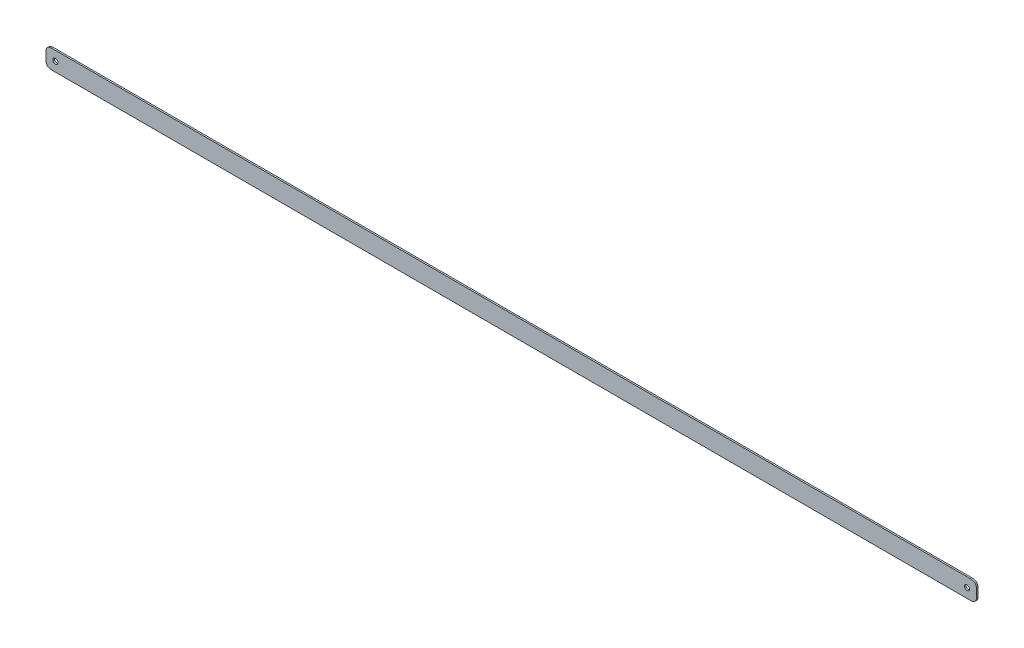
ISO-10303-21;
HEADER;
FILE_DESCRIPTION(('STEP AP214'),'2;1');
FILE_NAME('part.step','',(''),(''),'','','');
FILE_SCHEMA(('AUTOMOTIVE_DESIGN { 1 0 10303 214 1 1 1 1 }'));
ENDSEC;
DATA;
#1=APPLICATION_CONTEXT('core data for automotive mechanical design processes');
#2=APPLICATION_PROTOCOL_DEFINITION('international standard','automotive_design',2000,#1);
#3=PRODUCT_CONTEXT('',#1,'mechanical');
#4=PRODUCT('Part','Part','',(#3));
#5=PRODUCT_RELATED_PRODUCT_CATEGORY('part','',(#4));
#6=PRODUCT_DEFINITION_FORMATION('','',#4);
#7=PRODUCT_DEFINITION_CONTEXT('part definition',#1,'design');
#8=PRODUCT_DEFINITION('design','',#6,#7);
#9=PRODUCT_DEFINITION_SHAPE('','',#8);
#10=(LENGTH_UNIT() NAMED_UNIT(*) SI_UNIT(.MILLI.,.METRE.));
#11=(NAMED_UNIT(*) PLANE_ANGLE_UNIT() SI_UNIT($,.RADIAN.));
#12=(NAMED_UNIT(*) SI_UNIT($,.STERADIAN.) SOLID_ANGLE_UNIT());
#13=UNCERTAINTY_MEASURE_WITH_UNIT(LENGTH_MEASURE(1.E-05),#10,'distance_accuracy_value','');
#14=(GEOMETRIC_REPRESENTATION_CONTEXT(3) GLOBAL_UNCERTAINTY_ASSIGNED_CONTEXT((#13)) GLOBAL_UNIT_ASSIGNED_CONTEXT((#10,
#11,#12)) REPRESENTATION_CONTEXT('',''));
#15=CARTESIAN_POINT('',(0.,0.,0.));
#16=DIRECTION('',(0.,0.,1.));
#17=DIRECTION('',(1.,0.,0.));
#18=AXIS2_PLACEMENT_3D('',#15,#16,#17);
#19=CARTESIAN_POINT('',(-4.445,-4.445,1.5875));
#20=DIRECTION('',(0.,0.,1.));
#21=DIRECTION('',(1.,0.,0.));
#22=AXIS2_PLACEMENT_3D('',#19,#20,#21);
#23=PLANE('',#22);
#24=CARTESIAN_POINT('',(0.,0.,1.5875));
#25=DIRECTION('',(0.,0.,1.));
#26=DIRECTION('',(1.,0.,0.));
#27=AXIS2_PLACEMENT_3D('',#24,#25,#26);
#28=CIRCLE('',#27,2.54);
#29=CARTESIAN_POINT('',(2.54,0.,1.5875));
#30=VERTEX_POINT('',#29);
#31=EDGE_CURVE('E138',#30,#30,#28,.T.);
#32=ORIENTED_EDGE('',*,*,#31,.F.);
#33=EDGE_LOOP('',(#32));
#34=FACE_BOUND('',#33,.T.);
#35=CARTESIAN_POINT('',(-4.445,-4.445,1.5875));
#36=DIRECTION('',(0.,0.,1.));
#37=DIRECTION('',(1.,0.,0.));
#38=AXIS2_PLACEMENT_3D('',#35,#36,#37);
#39=CIRCLE('',#38,5.08);
#40=CARTESIAN_POINT('',(-9.525,-4.44499999999996,1.5875));
#41=VERTEX_POINT('',#40);
#42=CARTESIAN_POINT('',(-4.44499999999996,-9.525,1.5875));
#43=VERTEX_POINT('',#42);
#44=EDGE_CURVE('E151',#41,#43,#39,.T.);
#45=ORIENTED_EDGE('',*,*,#44,.T.);
#46=DIRECTION('',(1.,0.,0.));
#47=VECTOR('',#46,1.);
#48=CARTESIAN_POINT('',(-4.44499999999996,-9.525,1.5875));
#49=LINE('',#48,#47);
#50=CARTESIAN_POINT('',(929.119441224,-9.52499999999999,1.5875));
#51=VERTEX_POINT('',#50);
#52=EDGE_CURVE('E96',#43,#51,#49,.T.);
#53=ORIENTED_EDGE('',*,*,#52,.T.);
#54=CARTESIAN_POINT('',(929.119441224,-4.445,1.5875));
#55=DIRECTION('',(0.,0.,1.));
#56=DIRECTION('',(1.,0.,0.));
#57=AXIS2_PLACEMENT_3D('',#54,#55,#56);
#58=CIRCLE('',#57,5.07999999999999);
#59=CARTESIAN_POINT('',(934.199441224,-4.445,1.5875));
#60=VERTEX_POINT('',#59);
#61=EDGE_CURVE('E166',#51,#60,#58,.T.);
#62=ORIENTED_EDGE('',*,*,#61,.T.);
#63=DIRECTION('',(0.,1.,0.));
#64=VECTOR('',#63,1.);
#65=CARTESIAN_POINT('',(934.199441224,4.445,1.5875));
#66=LINE('',#65,#64);
#67=CARTESIAN_POINT('',(934.199441224,4.445,1.5875));
#68=VERTEX_POINT('',#67);
#69=EDGE_CURVE('E179',#60,#68,#66,.T.);
#70=ORIENTED_EDGE('',*,*,#69,.T.);
#71=CARTESIAN_POINT('',(929.119441224,4.445,1.5875));
#72=DIRECTION('',(0.,0.,1.));
#73=DIRECTION('',(-1.,0.,0.));
#74=AXIS2_PLACEMENT_3D('',#71,#72,#73);
#75=CIRCLE('',#74,5.07999999999999);
#76=CARTESIAN_POINT('',(929.119441224,9.525,1.5875));
#77=VERTEX_POINT('',#76);
#78=EDGE_CURVE('E115',#68,#77,#75,.T.);
#79=ORIENTED_EDGE('',*,*,#78,.T.);
#80=DIRECTION('',(-1.,0.,0.));
#81=VECTOR('',#80,1.);
#82=CARTESIAN_POINT('',(-4.44499999999997,9.525,1.5875));
#83=LINE('',#82,#81);
#84=CARTESIAN_POINT('',(-4.44499999999997,9.525,1.5875));
#85=VERTEX_POINT('',#84);
#86=EDGE_CURVE('E109',#77,#85,#83,.T.);
#87=ORIENTED_EDGE('',*,*,#86,.T.);
#88=CARTESIAN_POINT('',(-4.445,4.445,1.5875));
#89=DIRECTION('',(0.,0.,1.));
#90=DIRECTION('',(1.,0.,0.));
#91=AXIS2_PLACEMENT_3D('',#88,#89,#90);
#92=CIRCLE('',#91,5.08);
#93=CARTESIAN_POINT('',(-9.525,4.44499999999996,1.5875));
#94=VERTEX_POINT('',#93);
#95=EDGE_CURVE('E113',#85,#94,#92,.T.);
#96=ORIENTED_EDGE('',*,*,#95,.T.);
#97=DIRECTION('',(0.,-1.,0.));
#98=VECTOR('',#97,1.);
#99=CARTESIAN_POINT('',(-9.525,4.44499999999996,1.5875));
#100=LINE('',#99,#98);
#101=EDGE_CURVE('E53',#94,#41,#100,.T.);
#102=ORIENTED_EDGE('',*,*,#101,.T.);
#103=EDGE_LOOP('',(#45,#53,#62,#70,#79,#87,#96,#102));
#104=FACE_BOUND('',#103,.T.);
#105=CARTESIAN_POINT('',(924.674441224,0.,1.5875));
#106=DIRECTION('',(0.,0.,1.));
#107=DIRECTION('',(1.,0.,0.));
#108=AXIS2_PLACEMENT_3D('',#105,#106,#107);
#109=CIRCLE('',#108,2.53999999999996);
#110=CARTESIAN_POINT('',(927.214441224,0.,1.5875));
#111=VERTEX_POINT('',#110);
#112=EDGE_CURVE('E189',#111,#111,#109,.T.);
#113=ORIENTED_EDGE('',*,*,#112,.F.);
#114=EDGE_LOOP('',(#113));
#115=FACE_BOUND('',#114,.T.);
#116=ADVANCED_FACE('F36',(#34,#104,#115),#23,.T.);
#117=CARTESIAN_POINT('',(-4.445,-4.445,0.));
#118=DIRECTION('',(0.,0.,1.));
#119=DIRECTION('',(1.,0.,0.));
#120=AXIS2_PLACEMENT_3D('',#117,#118,#119);
#121=PLANE('',#120);
#122=CARTESIAN_POINT('',(-4.445,-4.445,0.));
#123=DIRECTION('',(0.,0.,1.));
#124=DIRECTION('',(1.,0.,0.));
#125=AXIS2_PLACEMENT_3D('',#122,#123,#124);
#126=CIRCLE('',#125,5.08);
#127=CARTESIAN_POINT('',(-9.525,-4.44499999999996,0.));
#128=VERTEX_POINT('',#127);
#129=CARTESIAN_POINT('',(-4.44499999999996,-9.525,0.));
#130=VERTEX_POINT('',#129);
#131=EDGE_CURVE('E134',#128,#130,#126,.T.);
#132=ORIENTED_EDGE('',*,*,#131,.F.);
#133=DIRECTION('',(0.,-1.,0.));
#134=VECTOR('',#133,1.);
#135=CARTESIAN_POINT('',(-9.525,4.44499999999996,0.));
#136=LINE('',#135,#134);
#137=CARTESIAN_POINT('',(-9.525,4.44499999999996,0.));
#138=VERTEX_POINT('',#137);
#139=EDGE_CURVE('E88',#138,#128,#136,.T.);
#140=ORIENTED_EDGE('',*,*,#139,.F.);
#141=CARTESIAN_POINT('',(-4.445,4.445,0.));
#142=DIRECTION('',(0.,0.,1.));
#143=DIRECTION('',(1.,0.,0.));
#144=AXIS2_PLACEMENT_3D('',#141,#142,#143);
#145=CIRCLE('',#144,5.08);
#146=CARTESIAN_POINT('',(-4.44499999999997,9.525,0.));
#147=VERTEX_POINT('',#146);
#148=EDGE_CURVE('E82',#147,#138,#145,.T.);
#149=ORIENTED_EDGE('',*,*,#148,.F.);
#150=DIRECTION('',(-1.,0.,0.));
#151=VECTOR('',#150,1.);
#152=CARTESIAN_POINT('',(-4.44499999999997,9.525,0.));
#153=LINE('',#152,#151);
#154=CARTESIAN_POINT('',(929.119441224,9.525,0.));
#155=VERTEX_POINT('',#154);
#156=EDGE_CURVE('E124',#155,#147,#153,.T.);
#157=ORIENTED_EDGE('',*,*,#156,.F.);
#158=CARTESIAN_POINT('',(929.119441224,4.445,0.));
#159=DIRECTION('',(0.,0.,1.));
#160=DIRECTION('',(-1.,0.,0.));
#161=AXIS2_PLACEMENT_3D('',#158,#159,#160);
#162=CIRCLE('',#161,5.07999999999999);
#163=CARTESIAN_POINT('',(934.199441224,4.445,0.));
#164=VERTEX_POINT('',#163);
#165=EDGE_CURVE('E145',#164,#155,#162,.T.);
#166=ORIENTED_EDGE('',*,*,#165,.F.);
#167=DIRECTION('',(0.,1.,0.));
#168=VECTOR('',#167,1.);
#169=CARTESIAN_POINT('',(934.199441224,4.445,0.));
#170=LINE('',#169,#168);
#171=CARTESIAN_POINT('',(934.199441224,-4.445,0.));
#172=VERTEX_POINT('',#171);
#173=EDGE_CURVE('E143',#172,#164,#170,.T.);
#174=ORIENTED_EDGE('',*,*,#173,.F.);
#175=CARTESIAN_POINT('',(929.119441224,-4.445,0.));
#176=DIRECTION('',(0.,0.,1.));
#177=DIRECTION('',(1.,0.,0.));
#178=AXIS2_PLACEMENT_3D('',#175,#176,#177);
#179=CIRCLE('',#178,5.07999999999999);
#180=CARTESIAN_POINT('',(929.119441224,-9.52499999999999,0.));
#181=VERTEX_POINT('',#180);
#182=EDGE_CURVE('E141',#181,#172,#179,.T.);
#183=ORIENTED_EDGE('',*,*,#182,.F.);
#184=DIRECTION('',(1.,0.,0.));
#185=VECTOR('',#184,1.);
#186=CARTESIAN_POINT('',(-4.44499999999996,-9.525,0.));
#187=LINE('',#186,#185);
#188=EDGE_CURVE('E137',#130,#181,#187,.T.);
#189=ORIENTED_EDGE('',*,*,#188,.F.);
#190=EDGE_LOOP('',(#132,#140,#149,#157,#166,#174,#183,#189));
#191=FACE_BOUND('',#190,.T.);
#192=CARTESIAN_POINT('',(0.,0.,0.));
#193=DIRECTION('',(0.,0.,1.));
#194=DIRECTION('',(1.,0.,0.));
#195=AXIS2_PLACEMENT_3D('',#192,#193,#194);
#196=CIRCLE('',#195,2.54);
#197=CARTESIAN_POINT('',(2.54,0.,0.));
#198=VERTEX_POINT('',#197);
#199=EDGE_CURVE('E186',#198,#198,#196,.T.);
#200=ORIENTED_EDGE('',*,*,#199,.T.);
#201=EDGE_LOOP('',(#200));
#202=FACE_BOUND('',#201,.T.);
#203=CARTESIAN_POINT('',(924.674441224,0.,0.));
#204=DIRECTION('',(0.,0.,1.));
#205=DIRECTION('',(1.,0.,0.));
#206=AXIS2_PLACEMENT_3D('',#203,#204,#205);
#207=CIRCLE('',#206,2.53999999999996);
#208=CARTESIAN_POINT('',(927.214441224,0.,0.));
#209=VERTEX_POINT('',#208);
#210=EDGE_CURVE('E192',#209,#209,#207,.T.);
#211=ORIENTED_EDGE('',*,*,#210,.T.);
#212=EDGE_LOOP('',(#211));
#213=FACE_BOUND('',#212,.T.);
#214=ADVANCED_FACE('F170',(#191,#202,#213),#121,.F.);
#215=CARTESIAN_POINT('',(-4.445,-4.445,1.5875));
#216=DIRECTION('',(0.,0.,-1.));
#217=DIRECTION('',(-1.,0.,0.));
#218=AXIS2_PLACEMENT_3D('',#215,#216,#217);
#219=CYLINDRICAL_SURFACE('',#218,5.08);
#220=ORIENTED_EDGE('',*,*,#131,.T.);
#221=DIRECTION('',(0.,0.,-1.));
#222=VECTOR('',#221,1.);
#223=CARTESIAN_POINT('',(-4.44499999999996,-9.525,1.5875));
#224=LINE('',#223,#222);
#225=EDGE_CURVE('E11',#43,#130,#224,.T.);
#226=ORIENTED_EDGE('',*,*,#225,.F.);
#227=ORIENTED_EDGE('',*,*,#44,.F.);
#228=DIRECTION('',(0.,0.,-1.));
#229=VECTOR('',#228,1.);
#230=CARTESIAN_POINT('',(-9.525,-4.44499999999996,1.5875));
#231=LINE('',#230,#229);
#232=EDGE_CURVE('E130',#41,#128,#231,.T.);
#233=ORIENTED_EDGE('',*,*,#232,.T.);
#234=EDGE_LOOP('',(#220,#226,#227,#233));
#235=FACE_BOUND('',#234,.T.);
#236=ADVANCED_FACE('F38',(#235),#219,.T.);
#237=CARTESIAN_POINT('',(-4.44499999999996,-9.525,1.5875));
#238=DIRECTION('',(0.,1.,0.));
#239=DIRECTION('',(0.,0.,1.));
#240=AXIS2_PLACEMENT_3D('',#237,#238,#239);
#241=PLANE('',#240);
#242=ORIENTED_EDGE('',*,*,#188,.T.);
#243=DIRECTION('',(0.,0.,-1.));
#244=VECTOR('',#243,1.);
#245=CARTESIAN_POINT('',(929.119441224,-9.52499999999999,1.5875));
#246=LINE('',#245,#244);
#247=EDGE_CURVE('E45',#51,#181,#246,.T.);
#248=ORIENTED_EDGE('',*,*,#247,.F.);
#249=ORIENTED_EDGE('',*,*,#52,.F.);
#250=ORIENTED_EDGE('',*,*,#225,.T.);
#251=EDGE_LOOP('',(#242,#248,#249,#250));
#252=FACE_BOUND('',#251,.T.);
#253=ADVANCED_FACE('F224',(#252),#241,.F.);
#254=CARTESIAN_POINT('',(929.119441224,-4.445,1.5875));
#255=DIRECTION('',(0.,0.,-1.));
#256=DIRECTION('',(-1.,0.,0.));
#257=AXIS2_PLACEMENT_3D('',#254,#255,#256);
#258=CYLINDRICAL_SURFACE('',#257,5.07999999999999);
#259=ORIENTED_EDGE('',*,*,#182,.T.);
#260=DIRECTION('',(0.,0.,-1.));
#261=VECTOR('',#260,1.);
#262=CARTESIAN_POINT('',(934.199441224,-4.445,1.5875));
#263=LINE('',#262,#261);
#264=EDGE_CURVE('E158',#60,#172,#263,.T.);
#265=ORIENTED_EDGE('',*,*,#264,.F.);
#266=ORIENTED_EDGE('',*,*,#61,.F.);
#267=ORIENTED_EDGE('',*,*,#247,.T.);
#268=EDGE_LOOP('',(#259,#265,#266,#267));
#269=FACE_BOUND('',#268,.T.);
#270=ADVANCED_FACE('F164',(#269),#258,.T.);
#271=CARTESIAN_POINT('',(934.199441224,4.445,1.5875));
#272=DIRECTION('',(-1.,0.,0.));
#273=DIRECTION('',(0.,0.,1.));
#274=AXIS2_PLACEMENT_3D('',#271,#272,#273);
#275=PLANE('',#274);
#276=ORIENTED_EDGE('',*,*,#173,.T.);
#277=DIRECTION('',(0.,0.,-1.));
#278=VECTOR('',#277,1.);
#279=CARTESIAN_POINT('',(934.199441224,4.445,1.5875));
#280=LINE('',#279,#278);
#281=EDGE_CURVE('E155',#68,#164,#280,.T.);
#282=ORIENTED_EDGE('',*,*,#281,.F.);
#283=ORIENTED_EDGE('',*,*,#69,.F.);
#284=ORIENTED_EDGE('',*,*,#264,.T.);
#285=EDGE_LOOP('',(#276,#282,#283,#284));
#286=FACE_BOUND('',#285,.T.);
#287=ADVANCED_FACE('F175',(#286),#275,.F.);
#288=CARTESIAN_POINT('',(929.119441224,4.445,1.5875));
#289=DIRECTION('',(0.,0.,-1.));
#290=DIRECTION('',(-1.,0.,0.));
#291=AXIS2_PLACEMENT_3D('',#288,#289,#290);
#292=CYLINDRICAL_SURFACE('',#291,5.07999999999999);
#293=ORIENTED_EDGE('',*,*,#165,.T.);
#294=DIRECTION('',(0.,0.,-1.));
#295=VECTOR('',#294,1.);
#296=CARTESIAN_POINT('',(929.119441224,9.525,1.5875));
#297=LINE('',#296,#295);
#298=EDGE_CURVE('E125',#77,#155,#297,.T.);
#299=ORIENTED_EDGE('',*,*,#298,.F.);
#300=ORIENTED_EDGE('',*,*,#78,.F.);
#301=ORIENTED_EDGE('',*,*,#281,.T.);
#302=EDGE_LOOP('',(#293,#299,#300,#301));
#303=FACE_BOUND('',#302,.T.);
#304=ADVANCED_FACE('F178',(#303),#292,.T.);
#305=CARTESIAN_POINT('',(-4.44499999999997,9.525,1.5875));
#306=DIRECTION('',(0.,-1.,0.));
#307=DIRECTION('',(0.,0.,-1.));
#308=AXIS2_PLACEMENT_3D('',#305,#306,#307);
#309=PLANE('',#308);
#310=ORIENTED_EDGE('',*,*,#156,.T.);
#311=DIRECTION('',(0.,0.,-1.));
#312=VECTOR('',#311,1.);
#313=CARTESIAN_POINT('',(-4.44499999999997,9.525,1.5875));
#314=LINE('',#313,#312);
#315=EDGE_CURVE('E121',#85,#147,#314,.T.);
#316=ORIENTED_EDGE('',*,*,#315,.F.);
#317=ORIENTED_EDGE('',*,*,#86,.F.);
#318=ORIENTED_EDGE('',*,*,#298,.T.);
#319=EDGE_LOOP('',(#310,#316,#317,#318));
#320=FACE_BOUND('',#319,.T.);
#321=ADVANCED_FACE('F122',(#320),#309,.F.);
#322=CARTESIAN_POINT('',(-4.445,4.445,1.5875));
#323=DIRECTION('',(0.,0.,-1.));
#324=DIRECTION('',(-1.,0.,0.));
#325=AXIS2_PLACEMENT_3D('',#322,#323,#324);
#326=CYLINDRICAL_SURFACE('',#325,5.08);
#327=ORIENTED_EDGE('',*,*,#148,.T.);
#328=DIRECTION('',(0.,0.,-1.));
#329=VECTOR('',#328,1.);
#330=CARTESIAN_POINT('',(-9.525,4.44499999999996,1.5875));
#331=LINE('',#330,#329);
#332=EDGE_CURVE('E126',#94,#138,#331,.T.);
#333=ORIENTED_EDGE('',*,*,#332,.F.);
#334=ORIENTED_EDGE('',*,*,#95,.F.);
#335=ORIENTED_EDGE('',*,*,#315,.T.);
#336=EDGE_LOOP('',(#327,#333,#334,#335));
#337=FACE_BOUND('',#336,.T.);
#338=ADVANCED_FACE('F128',(#337),#326,.T.);
#339=CARTESIAN_POINT('',(-9.525,4.44499999999996,1.5875));
#340=DIRECTION('',(1.,0.,0.));
#341=DIRECTION('',(0.,1.,0.));
#342=AXIS2_PLACEMENT_3D('',#339,#340,#341);
#343=PLANE('',#342);
#344=ORIENTED_EDGE('',*,*,#139,.T.);
#345=ORIENTED_EDGE('',*,*,#232,.F.);
#346=ORIENTED_EDGE('',*,*,#101,.F.);
#347=ORIENTED_EDGE('',*,*,#332,.T.);
#348=EDGE_LOOP('',(#344,#345,#346,#347));
#349=FACE_BOUND('',#348,.T.);
#350=ADVANCED_FACE('F212',(#349),#343,.F.);
#351=CARTESIAN_POINT('',(0.,0.,1.5875));
#352=DIRECTION('',(0.,0.,-1.));
#353=DIRECTION('',(-1.,0.,0.));
#354=AXIS2_PLACEMENT_3D('',#351,#352,#353);
#355=CYLINDRICAL_SURFACE('',#354,2.54);
#356=ORIENTED_EDGE('',*,*,#31,.T.);
#357=EDGE_LOOP('',(#356));
#358=FACE_BOUND('',#357,.T.);
#359=ORIENTED_EDGE('',*,*,#199,.F.);
#360=EDGE_LOOP('',(#359));
#361=FACE_BOUND('',#360,.T.);
#362=ADVANCED_FACE('F209',(#358,#361),#355,.F.);
#363=CARTESIAN_POINT('',(924.674441224,0.,1.5875));
#364=DIRECTION('',(0.,0.,-1.));
#365=DIRECTION('',(-1.,0.,0.));
#366=AXIS2_PLACEMENT_3D('',#363,#364,#365);
#367=CYLINDRICAL_SURFACE('',#366,2.53999999999996);
#368=ORIENTED_EDGE('',*,*,#112,.T.);
#369=EDGE_LOOP('',(#368));
#370=FACE_BOUND('',#369,.T.);
#371=ORIENTED_EDGE('',*,*,#210,.F.);
#372=EDGE_LOOP('',(#371));
#373=FACE_BOUND('',#372,.T.);
#374=ADVANCED_FACE('F198',(#370,#373),#367,.F.);
#375=CLOSED_SHELL('',(#116,#214,#236,#253,#270,#287,#304,#321,#338,#350,#362,#374));
#376=MANIFOLD_SOLID_BREP('B2',#375);
#377=ADVANCED_BREP_SHAPE_REPRESENTATION('',(#18,#376),#14);
#378=SHAPE_DEFINITION_REPRESENTATION(#9,#377);
ENDSEC;
END-ISO-10303-21;
